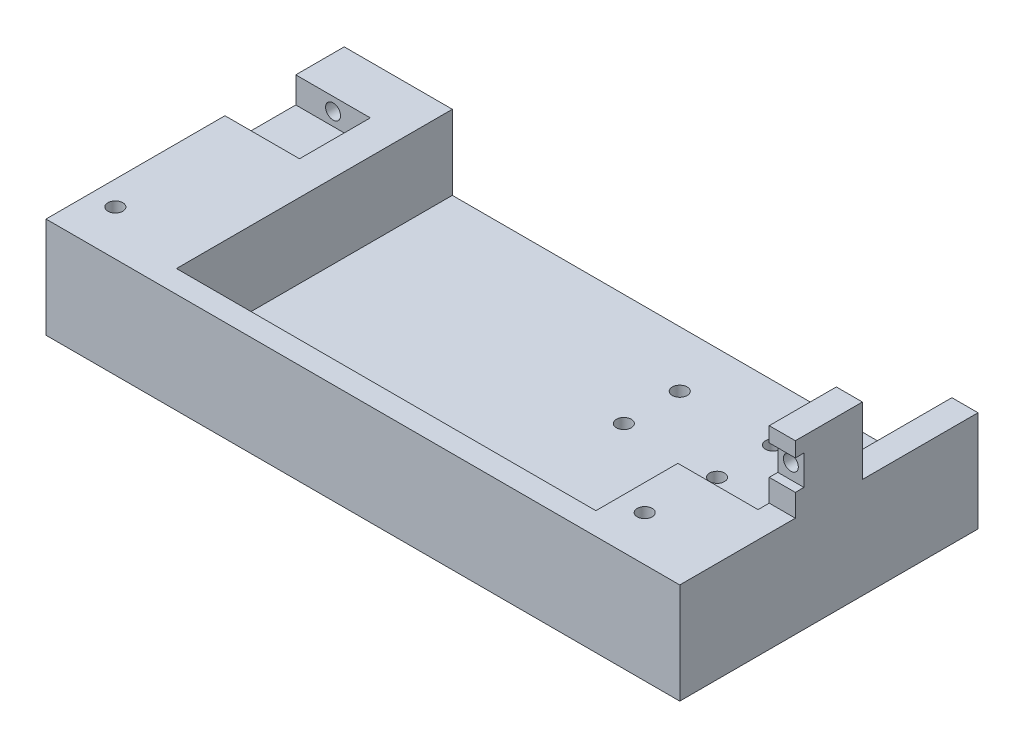
ISO-10303-21;
HEADER;
FILE_DESCRIPTION(('STEP AP214'),'2;1');
FILE_NAME('part.step','',(''),(''),'','','');
FILE_SCHEMA(('AUTOMOTIVE_DESIGN { 1 0 10303 214 1 1 1 1 }'));
ENDSEC;
DATA;
#1=APPLICATION_CONTEXT('core data for automotive mechanical design processes');
#2=APPLICATION_PROTOCOL_DEFINITION('international standard','automotive_design',2000,#1);
#3=PRODUCT_CONTEXT('',#1,'mechanical');
#4=PRODUCT('Part','Part','',(#3));
#5=PRODUCT_RELATED_PRODUCT_CATEGORY('part','',(#4));
#6=PRODUCT_DEFINITION_FORMATION('','',#4);
#7=PRODUCT_DEFINITION_CONTEXT('part definition',#1,'design');
#8=PRODUCT_DEFINITION('design','',#6,#7);
#9=PRODUCT_DEFINITION_SHAPE('','',#8);
#10=(LENGTH_UNIT() NAMED_UNIT(*) SI_UNIT(.MILLI.,.METRE.));
#11=(NAMED_UNIT(*) PLANE_ANGLE_UNIT() SI_UNIT($,.RADIAN.));
#12=(NAMED_UNIT(*) SI_UNIT($,.STERADIAN.) SOLID_ANGLE_UNIT());
#13=UNCERTAINTY_MEASURE_WITH_UNIT(LENGTH_MEASURE(1.E-05),#10,'distance_accuracy_value','');
#14=(GEOMETRIC_REPRESENTATION_CONTEXT(3) GLOBAL_UNCERTAINTY_ASSIGNED_CONTEXT((#13)) GLOBAL_UNIT_ASSIGNED_CONTEXT((#10,
#11,#12)) REPRESENTATION_CONTEXT('',''));
#15=CARTESIAN_POINT('',(0.,0.,0.));
#16=DIRECTION('',(0.,0.,1.));
#17=DIRECTION('',(1.,0.,0.));
#18=AXIS2_PLACEMENT_3D('',#15,#16,#17);
#19=CARTESIAN_POINT('',(253.170316301703,25.,-8.70802919708036));
#20=DIRECTION('',(1.,0.,0.));
#21=DIRECTION('',(0.,0.,1.));
#22=AXIS2_PLACEMENT_3D('',#19,#20,#21);
#23=PLANE('',#22);
#24=DIRECTION('',(0.,-1.,0.));
#25=VECTOR('',#24,1.);
#26=CARTESIAN_POINT('',(253.170316301703,7.,12.2919708029196));
#27=LINE('',#26,#25);
#28=CARTESIAN_POINT('',(253.170316301703,7.,12.2919708029196));
#29=VERTEX_POINT('',#28);
#30=CARTESIAN_POINT('',(253.170316301703,-13.,12.2919708029196));
#31=VERTEX_POINT('',#30);
#32=EDGE_CURVE('E225',#29,#31,#27,.T.);
#33=ORIENTED_EDGE('',*,*,#32,.F.);
#34=DIRECTION('',(0.,0.,1.));
#35=VECTOR('',#34,1.);
#36=CARTESIAN_POINT('',(253.170316301703,7.,40.2919708029196));
#37=LINE('',#36,#35);
#38=CARTESIAN_POINT('',(253.170316301703,7.,9.29197080291963));
#39=VERTEX_POINT('',#38);
#40=EDGE_CURVE('E228',#39,#29,#37,.T.);
#41=ORIENTED_EDGE('',*,*,#40,.F.);
#42=DIRECTION('',(0.,-1.,0.));
#43=VECTOR('',#42,1.);
#44=CARTESIAN_POINT('',(253.170316301703,25.,9.29197080291964));
#45=LINE('',#44,#43);
#46=CARTESIAN_POINT('',(253.170316301703,13.,9.29197080291964));
#47=VERTEX_POINT('',#46);
#48=EDGE_CURVE('E334',#47,#39,#45,.T.);
#49=ORIENTED_EDGE('',*,*,#48,.F.);
#50=DIRECTION('',(0.,0.,1.));
#51=VECTOR('',#50,1.);
#52=CARTESIAN_POINT('',(253.170316301703,13.,6.99197080291964));
#53=LINE('',#52,#51);
#54=CARTESIAN_POINT('',(253.170316301703,13.,6.99197080291964));
#55=VERTEX_POINT('',#54);
#56=EDGE_CURVE('E308',#55,#47,#53,.T.);
#57=ORIENTED_EDGE('',*,*,#56,.F.);
#58=DIRECTION('',(0.,1.,0.));
#59=VECTOR('',#58,1.);
#60=CARTESIAN_POINT('',(253.170316301703,21.,6.99197080291964));
#61=LINE('',#60,#59);
#62=CARTESIAN_POINT('',(253.170316301703,21.,6.99197080291964));
#63=VERTEX_POINT('',#62);
#64=EDGE_CURVE('E293',#55,#63,#61,.T.);
#65=ORIENTED_EDGE('',*,*,#64,.T.);
#66=DIRECTION('',(0.,0.,1.));
#67=VECTOR('',#66,1.);
#68=CARTESIAN_POINT('',(253.170316301703,21.,6.99197080291964));
#69=LINE('',#68,#67);
#70=CARTESIAN_POINT('',(253.170316301703,21.,9.29197080291964));
#71=VERTEX_POINT('',#70);
#72=EDGE_CURVE('E305',#63,#71,#69,.T.);
#73=ORIENTED_EDGE('',*,*,#72,.T.);
#74=CARTESIAN_POINT('',(253.170316301703,25.,9.29197080291964));
#75=VERTEX_POINT('',#74);
#76=EDGE_CURVE('E335',#75,#71,#45,.T.);
#77=ORIENTED_EDGE('',*,*,#76,.F.);
#78=DIRECTION('',(0.,0.,-1.));
#79=VECTOR('',#78,1.);
#80=CARTESIAN_POINT('',(253.170316301703,25.,-8.70802919708036));
#81=LINE('',#80,#79);
#82=CARTESIAN_POINT('',(253.170316301703,25.,-8.70802919708036));
#83=VERTEX_POINT('',#82);
#84=EDGE_CURVE('E321',#75,#83,#81,.T.);
#85=ORIENTED_EDGE('',*,*,#84,.T.);
#86=DIRECTION('',(0.,-1.,0.));
#87=VECTOR('',#86,1.);
#88=CARTESIAN_POINT('',(253.170316301703,25.,-8.70802919708036));
#89=LINE('',#88,#87);
#90=CARTESIAN_POINT('',(253.170316301703,7.,-8.70802919708036));
#91=VERTEX_POINT('',#90);
#92=EDGE_CURVE('E331',#83,#91,#89,.T.);
#93=ORIENTED_EDGE('',*,*,#92,.T.);
#94=CARTESIAN_POINT('',(253.170316301703,7.,-39.7080291970804));
#95=VERTEX_POINT('',#94);
#96=EDGE_CURVE('E237',#95,#91,#37,.T.);
#97=ORIENTED_EDGE('',*,*,#96,.F.);
#98=DIRECTION('',(0.,1.,0.));
#99=VECTOR('',#98,1.);
#100=CARTESIAN_POINT('',(253.170316301703,-13.,-39.7080291970804));
#101=LINE('',#100,#99);
#102=CARTESIAN_POINT('',(253.170316301703,-13.,-39.7080291970804));
#103=VERTEX_POINT('',#102);
#104=EDGE_CURVE('E242',#103,#95,#101,.T.);
#105=ORIENTED_EDGE('',*,*,#104,.F.);
#106=DIRECTION('',(0.,0.,1.));
#107=VECTOR('',#106,1.);
#108=CARTESIAN_POINT('',(253.170316301703,-13.,40.2919708029196));
#109=LINE('',#108,#107);
#110=EDGE_CURVE('E229',#103,#31,#109,.T.);
#111=ORIENTED_EDGE('',*,*,#110,.T.);
#112=EDGE_LOOP('',(#33,#41,#49,#57,#65,#73,#77,#85,#93,#97,#105,#111));
#113=FACE_BOUND('',#112,.T.);
#114=ADVANCED_FACE('F32',(#113),#23,.F.);
#115=CARTESIAN_POINT('',(119.170316301703,-13.,40.2919708029197));
#116=DIRECTION('',(-1.,0.,0.));
#117=DIRECTION('',(0.,0.,-1.));
#118=AXIS2_PLACEMENT_3D('',#115,#116,#117);
#119=PLANE('',#118);
#120=DIRECTION('',(0.,0.,-1.));
#121=VECTOR('',#120,1.);
#122=CARTESIAN_POINT('',(119.170316301703,-13.,40.2919708029197));
#123=LINE('',#122,#121);
#124=CARTESIAN_POINT('',(119.170316301703,-13.,34.2919708029197));
#125=VERTEX_POINT('',#124);
#126=CARTESIAN_POINT('',(119.170316301703,-13.,-39.7080291970803));
#127=VERTEX_POINT('',#126);
#128=EDGE_CURVE('E206',#125,#127,#123,.T.);
#129=ORIENTED_EDGE('',*,*,#128,.T.);
#130=DIRECTION('',(0.,1.,0.));
#131=VECTOR('',#130,1.);
#132=CARTESIAN_POINT('',(119.170316301703,-13.,-39.7080291970803));
#133=LINE('',#132,#131);
#134=CARTESIAN_POINT('',(119.170316301703,7.,-39.7080291970803));
#135=VERTEX_POINT('',#134);
#136=EDGE_CURVE('E236',#127,#135,#133,.T.);
#137=ORIENTED_EDGE('',*,*,#136,.T.);
#138=DIRECTION('',(0.,0.,-1.));
#139=VECTOR('',#138,1.);
#140=CARTESIAN_POINT('',(119.170316301703,7.,40.2919708029197));
#141=LINE('',#140,#139);
#142=CARTESIAN_POINT('',(119.170316301703,7.,34.2919708029197));
#143=VERTEX_POINT('',#142);
#144=EDGE_CURVE('E232',#143,#135,#141,.T.);
#145=ORIENTED_EDGE('',*,*,#144,.F.);
#146=DIRECTION('',(0.,1.,0.));
#147=VECTOR('',#146,1.);
#148=CARTESIAN_POINT('',(119.170316301703,-13.,34.2919708029197));
#149=LINE('',#148,#147);
#150=EDGE_CURVE('E194',#125,#143,#149,.T.);
#151=ORIENTED_EDGE('',*,*,#150,.F.);
#152=EDGE_LOOP('',(#129,#137,#145,#151));
#153=FACE_BOUND('',#152,.T.);
#154=ADVANCED_FACE('F432',(#153),#119,.F.);
#155=CARTESIAN_POINT('',(180.340632603406,-13.,0.));
#156=DIRECTION('',(0.,-1.,0.));
#157=DIRECTION('',(0.,0.,-1.));
#158=AXIS2_PLACEMENT_3D('',#155,#156,#157);
#159=PLANE('',#158);
#160=CARTESIAN_POINT('',(195.170316301703,-13.,-24.7080291970803));
#161=DIRECTION('',(0.,-1.,0.));
#162=DIRECTION('',(0.,0.,1.));
#163=AXIS2_PLACEMENT_3D('',#160,#161,#162);
#164=CIRCLE('',#163,2.);
#165=CARTESIAN_POINT('',(195.170316301703,-13.,-22.7080291970803));
#166=VERTEX_POINT('',#165);
#167=EDGE_CURVE('E402',#166,#166,#164,.T.);
#168=ORIENTED_EDGE('',*,*,#167,.T.);
#169=EDGE_LOOP('',(#168));
#170=FACE_BOUND('',#169,.T.);
#171=CARTESIAN_POINT('',(195.170316301703,-13.,-9.70802919708035));
#172=DIRECTION('',(0.,-1.,0.));
#173=DIRECTION('',(0.,0.,1.));
#174=AXIS2_PLACEMENT_3D('',#171,#172,#173);
#175=CIRCLE('',#174,2.);
#176=CARTESIAN_POINT('',(195.170316301703,-13.,-7.70802919708035));
#177=VERTEX_POINT('',#176);
#178=EDGE_CURVE('E404',#177,#177,#175,.T.);
#179=ORIENTED_EDGE('',*,*,#178,.T.);
#180=EDGE_LOOP('',(#179));
#181=FACE_BOUND('',#180,.T.);
#182=CARTESIAN_POINT('',(220.170316301703,-13.,-9.70802919708036));
#183=DIRECTION('',(0.,-1.,0.));
#184=DIRECTION('',(0.,0.,1.));
#185=AXIS2_PLACEMENT_3D('',#182,#183,#184);
#186=CIRCLE('',#185,2.);
#187=CARTESIAN_POINT('',(220.170316301703,-13.,-7.70802919708035));
#188=VERTEX_POINT('',#187);
#189=EDGE_CURVE('E407',#188,#188,#186,.T.);
#190=ORIENTED_EDGE('',*,*,#189,.T.);
#191=EDGE_LOOP('',(#190));
#192=FACE_BOUND('',#191,.T.);
#193=CARTESIAN_POINT('',(220.170316301703,-13.,-24.7080291970804));
#194=DIRECTION('',(0.,-1.,0.));
#195=DIRECTION('',(0.,0.,1.));
#196=AXIS2_PLACEMENT_3D('',#193,#194,#195);
#197=CIRCLE('',#196,2.);
#198=CARTESIAN_POINT('',(220.170316301703,-13.,-22.7080291970804));
#199=VERTEX_POINT('',#198);
#200=EDGE_CURVE('E384',#199,#199,#197,.T.);
#201=ORIENTED_EDGE('',*,*,#200,.T.);
#202=EDGE_LOOP('',(#201));
#203=FACE_BOUND('',#202,.T.);
#204=DIRECTION('',(1.,0.,0.));
#205=VECTOR('',#204,1.);
#206=CARTESIAN_POINT('',(253.170316301703,-13.,12.2919708029196));
#207=LINE('',#206,#205);
#208=CARTESIAN_POINT('',(231.670316301703,-13.,12.2919708029196));
#209=VERTEX_POINT('',#208);
#210=EDGE_CURVE('E223',#209,#31,#207,.T.);
#211=ORIENTED_EDGE('',*,*,#210,.T.);
#212=ORIENTED_EDGE('',*,*,#110,.F.);
#213=DIRECTION('',(1.,0.,0.));
#214=VECTOR('',#213,1.);
#215=CARTESIAN_POINT('',(253.170316301703,-13.,-39.7080291970804));
#216=LINE('',#215,#214);
#217=EDGE_CURVE('E234',#127,#103,#216,.T.);
#218=ORIENTED_EDGE('',*,*,#217,.F.);
#219=ORIENTED_EDGE('',*,*,#128,.F.);
#220=DIRECTION('',(-1.,0.,0.));
#221=VECTOR('',#220,1.);
#222=CARTESIAN_POINT('',(231.670316301703,-13.,34.2919708029196));
#223=LINE('',#222,#221);
#224=CARTESIAN_POINT('',(231.670316301703,-13.,34.2919708029196));
#225=VERTEX_POINT('',#224);
#226=EDGE_CURVE('E188',#225,#125,#223,.T.);
#227=ORIENTED_EDGE('',*,*,#226,.F.);
#228=DIRECTION('',(0.,0.,1.));
#229=VECTOR('',#228,1.);
#230=CARTESIAN_POINT('',(231.670316301703,-13.,12.2919708029196));
#231=LINE('',#230,#229);
#232=EDGE_CURVE('E197',#209,#225,#231,.T.);
#233=ORIENTED_EDGE('',*,*,#232,.F.);
#234=EDGE_LOOP('',(#211,#212,#218,#219,#227,#233));
#235=FACE_BOUND('',#234,.T.);
#236=ADVANCED_FACE('F204',(#170,#181,#192,#203,#235),#159,.F.);
#237=CARTESIAN_POINT('',(180.340632603406,7.,0.));
#238=DIRECTION('',(0.,1.,0.));
#239=DIRECTION('',(0.,0.,1.));
#240=AXIS2_PLACEMENT_3D('',#237,#238,#239);
#241=PLANE('',#240);
#242=ORIENTED_EDGE('',*,*,#96,.T.);
#243=DIRECTION('',(1.,0.,0.));
#244=VECTOR('',#243,1.);
#245=CARTESIAN_POINT('',(260.170316301703,7.,-8.70802919708036));
#246=LINE('',#245,#244);
#247=CARTESIAN_POINT('',(260.170316301703,7.,-8.70802919708036));
#248=VERTEX_POINT('',#247);
#249=EDGE_CURVE('E319',#91,#248,#246,.T.);
#250=ORIENTED_EDGE('',*,*,#249,.T.);
#251=DIRECTION('',(0.,0.,1.));
#252=VECTOR('',#251,1.);
#253=CARTESIAN_POINT('',(260.170316301703,7.,-39.7080291970804));
#254=LINE('',#253,#252);
#255=CARTESIAN_POINT('',(260.170316301703,7.,-39.7080291970804));
#256=VERTEX_POINT('',#255);
#257=EDGE_CURVE('E343',#256,#248,#254,.T.);
#258=ORIENTED_EDGE('',*,*,#257,.F.);
#259=DIRECTION('',(1.,0.,0.));
#260=VECTOR('',#259,1.);
#261=CARTESIAN_POINT('',(260.170316301703,7.,-39.7080291970804));
#262=LINE('',#261,#260);
#263=EDGE_CURVE('E353',#95,#256,#262,.T.);
#264=ORIENTED_EDGE('',*,*,#263,.F.);
#265=EDGE_LOOP('',(#242,#250,#258,#264));
#266=FACE_BOUND('',#265,.T.);
#267=ADVANCED_FACE('F455',(#266),#241,.T.);
#268=CARTESIAN_POINT('',(260.170316301703,25.,9.29197080291963));
#269=DIRECTION('',(0.,0.,-1.));
#270=DIRECTION('',(1.,0.,0.));
#271=AXIS2_PLACEMENT_3D('',#268,#269,#270);
#272=PLANE('',#271);
#273=DIRECTION('',(0.,-1.,0.));
#274=VECTOR('',#273,1.);
#275=CARTESIAN_POINT('',(260.170316301703,25.,9.29197080291963));
#276=LINE('',#275,#274);
#277=CARTESIAN_POINT('',(260.170316301703,25.,9.29197080291963));
#278=VERTEX_POINT('',#277);
#279=CARTESIAN_POINT('',(260.170316301703,21.,9.29197080291963));
#280=VERTEX_POINT('',#279);
#281=EDGE_CURVE('E339',#278,#280,#276,.T.);
#282=ORIENTED_EDGE('',*,*,#281,.F.);
#283=DIRECTION('',(-1.,0.,0.));
#284=VECTOR('',#283,1.);
#285=CARTESIAN_POINT('',(260.170316301703,25.,9.29197080291963));
#286=LINE('',#285,#284);
#287=EDGE_CURVE('E318',#278,#75,#286,.T.);
#288=ORIENTED_EDGE('',*,*,#287,.T.);
#289=ORIENTED_EDGE('',*,*,#76,.T.);
#290=DIRECTION('',(1.,0.,0.));
#291=VECTOR('',#290,1.);
#292=CARTESIAN_POINT('',(260.170316301703,21.,9.29197080291963));
#293=LINE('',#292,#291);
#294=EDGE_CURVE('E291',#71,#280,#293,.T.);
#295=ORIENTED_EDGE('',*,*,#294,.T.);
#296=EDGE_LOOP('',(#282,#288,#289,#295));
#297=FACE_BOUND('',#296,.T.);
#298=ADVANCED_FACE('F450',(#297),#272,.F.);
#299=CARTESIAN_POINT('',(256.670316301703,17.,11.2919708029196));
#300=DIRECTION('',(0.,0.,-1.));
#301=DIRECTION('',(1.,0.,0.));
#302=AXIS2_PLACEMENT_3D('',#299,#300,#301);
#303=CYLINDRICAL_SURFACE('',#302,2.);
#304=CARTESIAN_POINT('',(256.670316301703,17.,-8.70802919708036));
#305=DIRECTION('',(0.,0.,1.));
#306=DIRECTION('',(1.,0.,0.));
#307=AXIS2_PLACEMENT_3D('',#304,#305,#306);
#308=CIRCLE('',#307,2.);
#309=CARTESIAN_POINT('',(258.670316301703,17.,-8.70802919708036));
#310=VERTEX_POINT('',#309);
#311=EDGE_CURVE('E312',#310,#310,#308,.T.);
#312=ORIENTED_EDGE('',*,*,#311,.F.);
#313=EDGE_LOOP('',(#312));
#314=FACE_BOUND('',#313,.T.);
#315=CARTESIAN_POINT('',(256.670316301703,17.,6.99197080291963));
#316=DIRECTION('',(0.,0.,-1.));
#317=DIRECTION('',(-1.,0.,0.));
#318=AXIS2_PLACEMENT_3D('',#315,#316,#317);
#319=CIRCLE('',#318,2.);
#320=CARTESIAN_POINT('',(254.670316301703,17.,6.99197080291964));
#321=VERTEX_POINT('',#320);
#322=EDGE_CURVE('E304',#321,#321,#319,.F.);
#323=ORIENTED_EDGE('',*,*,#322,.T.);
#324=EDGE_LOOP('',(#323));
#325=FACE_BOUND('',#324,.T.);
#326=ADVANCED_FACE('F468',(#314,#325),#303,.F.);
#327=CARTESIAN_POINT('',(260.170316301703,7.,-39.7080291970804));
#328=DIRECTION('',(-1.,0.,0.));
#329=DIRECTION('',(0.,0.,-1.));
#330=AXIS2_PLACEMENT_3D('',#327,#328,#329);
#331=PLANE('',#330);
#332=DIRECTION('',(0.,-1.,0.));
#333=VECTOR('',#332,1.);
#334=CARTESIAN_POINT('',(260.170316301703,21.,6.99197080291963));
#335=LINE('',#334,#333);
#336=CARTESIAN_POINT('',(260.170316301703,21.,6.99197080291963));
#337=VERTEX_POINT('',#336);
#338=CARTESIAN_POINT('',(260.170316301703,13.,6.99197080291963));
#339=VERTEX_POINT('',#338);
#340=EDGE_CURVE('E288',#337,#339,#335,.T.);
#341=ORIENTED_EDGE('',*,*,#340,.T.);
#342=DIRECTION('',(0.,0.,1.));
#343=VECTOR('',#342,1.);
#344=CARTESIAN_POINT('',(260.170316301703,13.,6.99197080291963));
#345=LINE('',#344,#343);
#346=CARTESIAN_POINT('',(260.170316301703,13.,9.29197080291963));
#347=VERTEX_POINT('',#346);
#348=EDGE_CURVE('E298',#339,#347,#345,.T.);
#349=ORIENTED_EDGE('',*,*,#348,.T.);
#350=CARTESIAN_POINT('',(260.170316301703,7.,9.29197080291963));
#351=VERTEX_POINT('',#350);
#352=EDGE_CURVE('E338',#347,#351,#276,.T.);
#353=ORIENTED_EDGE('',*,*,#352,.T.);
#354=CARTESIAN_POINT('',(260.170316301703,7.,40.2919708029196));
#355=VERTEX_POINT('',#354);
#356=EDGE_CURVE('E342',#351,#355,#254,.T.);
#357=ORIENTED_EDGE('',*,*,#356,.T.);
#358=DIRECTION('',(0.,-1.,0.));
#359=VECTOR('',#358,1.);
#360=CARTESIAN_POINT('',(260.170316301703,7.,40.2919708029196));
#361=LINE('',#360,#359);
#362=CARTESIAN_POINT('',(260.170316301703,-20.,40.2919708029196));
#363=VERTEX_POINT('',#362);
#364=EDGE_CURVE('E365',#355,#363,#361,.T.);
#365=ORIENTED_EDGE('',*,*,#364,.T.);
#366=DIRECTION('',(0.,0.,-1.));
#367=VECTOR('',#366,1.);
#368=CARTESIAN_POINT('',(260.170316301703,-20.,40.2919708029196));
#369=LINE('',#368,#367);
#370=CARTESIAN_POINT('',(260.170316301703,-20.,-39.7080291970804));
#371=VERTEX_POINT('',#370);
#372=EDGE_CURVE('E248',#363,#371,#369,.T.);
#373=ORIENTED_EDGE('',*,*,#372,.T.);
#374=DIRECTION('',(0.,-1.,0.));
#375=VECTOR('',#374,1.);
#376=CARTESIAN_POINT('',(260.170316301703,7.,-39.7080291970804));
#377=LINE('',#376,#375);
#378=EDGE_CURVE('E356',#256,#371,#377,.T.);
#379=ORIENTED_EDGE('',*,*,#378,.F.);
#380=ORIENTED_EDGE('',*,*,#257,.T.);
#381=DIRECTION('',(0.,-1.,0.));
#382=VECTOR('',#381,1.);
#383=CARTESIAN_POINT('',(260.170316301703,25.,-8.70802919708036));
#384=LINE('',#383,#382);
#385=CARTESIAN_POINT('',(260.170316301703,25.,-8.70802919708036));
#386=VERTEX_POINT('',#385);
#387=EDGE_CURVE('E326',#386,#248,#384,.T.);
#388=ORIENTED_EDGE('',*,*,#387,.F.);
#389=DIRECTION('',(0.,0.,1.));
#390=VECTOR('',#389,1.);
#391=CARTESIAN_POINT('',(260.170316301703,25.,-8.70802919708036));
#392=LINE('',#391,#390);
#393=EDGE_CURVE('E316',#386,#278,#392,.T.);
#394=ORIENTED_EDGE('',*,*,#393,.T.);
#395=ORIENTED_EDGE('',*,*,#281,.T.);
#396=DIRECTION('',(0.,0.,1.));
#397=VECTOR('',#396,1.);
#398=CARTESIAN_POINT('',(260.170316301703,21.,6.99197080291963));
#399=LINE('',#398,#397);
#400=EDGE_CURVE('E302',#337,#280,#399,.T.);
#401=ORIENTED_EDGE('',*,*,#400,.F.);
#402=EDGE_LOOP('',(#341,#349,#353,#357,#365,#373,#379,#380,#388,#394,#395,#401));
#403=FACE_BOUND('',#402,.T.);
#404=ADVANCED_FACE('F34',(#403),#331,.F.);
#405=CARTESIAN_POINT('',(260.170316301703,7.,40.2919708029196));
#406=DIRECTION('',(0.,0.,-1.));
#407=DIRECTION('',(1.,0.,0.));
#408=AXIS2_PLACEMENT_3D('',#405,#406,#407);
#409=PLANE('',#408);
#410=DIRECTION('',(0.,-1.,0.));
#411=VECTOR('',#410,1.);
#412=CARTESIAN_POINT('',(90.1703163017031,7.,40.2919708029197));
#413=LINE('',#412,#411);
#414=CARTESIAN_POINT('',(90.1703163017031,7.,40.2919708029197));
#415=VERTEX_POINT('',#414);
#416=CARTESIAN_POINT('',(90.1703163017032,-20.,40.2919708029197));
#417=VERTEX_POINT('',#416);
#418=EDGE_CURVE('E362',#415,#417,#413,.T.);
#419=ORIENTED_EDGE('',*,*,#418,.T.);
#420=DIRECTION('',(1.,0.,0.));
#421=VECTOR('',#420,1.);
#422=CARTESIAN_POINT('',(260.170316301703,-20.,40.2919708029196));
#423=LINE('',#422,#421);
#424=EDGE_CURVE('E255',#417,#363,#423,.T.);
#425=ORIENTED_EDGE('',*,*,#424,.T.);
#426=ORIENTED_EDGE('',*,*,#364,.F.);
#427=DIRECTION('',(-1.,0.,0.));
#428=VECTOR('',#427,1.);
#429=CARTESIAN_POINT('',(260.170316301703,7.,40.2919708029196));
#430=LINE('',#429,#428);
#431=EDGE_CURVE('E346',#355,#415,#430,.T.);
#432=ORIENTED_EDGE('',*,*,#431,.T.);
#433=EDGE_LOOP('',(#419,#425,#426,#432));
#434=FACE_BOUND('',#433,.T.);
#435=ADVANCED_FACE('F461',(#434),#409,.F.);
#436=CARTESIAN_POINT('',(90.1703163017031,7.,-39.7080291970803));
#437=DIRECTION('',(1.,0.,0.));
#438=DIRECTION('',(0.,0.,1.));
#439=AXIS2_PLACEMENT_3D('',#436,#437,#438);
#440=PLANE('',#439);
#441=ORIENTED_EDGE('',*,*,#418,.F.);
#442=DIRECTION('',(0.,0.,-1.));
#443=VECTOR('',#442,1.);
#444=CARTESIAN_POINT('',(90.1703163017031,7.,-39.7080291970803));
#445=LINE('',#444,#443);
#446=CARTESIAN_POINT('',(90.1703163017031,7.,-7.70802919708031));
#447=VERTEX_POINT('',#446);
#448=EDGE_CURVE('E350',#415,#447,#445,.T.);
#449=ORIENTED_EDGE('',*,*,#448,.T.);
#450=DIRECTION('',(0.,1.,0.));
#451=VECTOR('',#450,1.);
#452=CARTESIAN_POINT('',(90.1703163017031,-4.,-7.70802919708031));
#453=LINE('',#452,#451);
#454=CARTESIAN_POINT('',(90.1703163017031,0.,-7.70802919708031));
#455=VERTEX_POINT('',#454);
#456=EDGE_CURVE('E284',#455,#447,#453,.T.);
#457=ORIENTED_EDGE('',*,*,#456,.F.);
#458=DIRECTION('',(0.,0.,1.));
#459=VECTOR('',#458,1.);
#460=CARTESIAN_POINT('',(90.1703163017032,0.,40.2919708029197));
#461=LINE('',#460,#459);
#462=CARTESIAN_POINT('',(90.1703163017031,0.,-26.7080291970803));
#463=VERTEX_POINT('',#462);
#464=EDGE_CURVE('E245',#463,#455,#461,.T.);
#465=ORIENTED_EDGE('',*,*,#464,.F.);
#466=DIRECTION('',(0.,1.,0.));
#467=VECTOR('',#466,1.);
#468=CARTESIAN_POINT('',(90.1703163017031,-4.,-26.7080291970803));
#469=LINE('',#468,#467);
#470=CARTESIAN_POINT('',(90.1703163017031,7.,-26.7080291970803));
#471=VERTEX_POINT('',#470);
#472=EDGE_CURVE('E281',#463,#471,#469,.T.);
#473=ORIENTED_EDGE('',*,*,#472,.T.);
#474=CARTESIAN_POINT('',(90.1703163017031,7.,-39.7080291970803));
#475=VERTEX_POINT('',#474);
#476=EDGE_CURVE('E349',#471,#475,#445,.T.);
#477=ORIENTED_EDGE('',*,*,#476,.T.);
#478=DIRECTION('',(0.,-1.,0.));
#479=VECTOR('',#478,1.);
#480=CARTESIAN_POINT('',(90.1703163017031,7.,-39.7080291970803));
#481=LINE('',#480,#479);
#482=CARTESIAN_POINT('',(90.1703163017031,-20.,-39.7080291970803));
#483=VERTEX_POINT('',#482);
#484=EDGE_CURVE('E359',#475,#483,#481,.T.);
#485=ORIENTED_EDGE('',*,*,#484,.T.);
#486=DIRECTION('',(0.,0.,1.));
#487=VECTOR('',#486,1.);
#488=CARTESIAN_POINT('',(90.1703163017032,-20.,40.2919708029197));
#489=LINE('',#488,#487);
#490=EDGE_CURVE('E253',#483,#417,#489,.T.);
#491=ORIENTED_EDGE('',*,*,#490,.T.);
#492=EDGE_LOOP('',(#441,#449,#457,#465,#473,#477,#485,#491));
#493=FACE_BOUND('',#492,.T.);
#494=ADVANCED_FACE('F458',(#493),#440,.F.);
#495=CARTESIAN_POINT('',(260.170316301703,7.,-39.7080291970804));
#496=DIRECTION('',(0.,0.,1.));
#497=DIRECTION('',(-1.,0.,0.));
#498=AXIS2_PLACEMENT_3D('',#495,#496,#497);
#499=PLANE('',#498);
#500=ORIENTED_EDGE('',*,*,#263,.T.);
#501=ORIENTED_EDGE('',*,*,#378,.T.);
#502=DIRECTION('',(-1.,0.,0.));
#503=VECTOR('',#502,1.);
#504=CARTESIAN_POINT('',(260.170316301703,-20.,-39.7080291970804));
#505=LINE('',#504,#503);
#506=EDGE_CURVE('E251',#371,#483,#505,.T.);
#507=ORIENTED_EDGE('',*,*,#506,.T.);
#508=ORIENTED_EDGE('',*,*,#484,.F.);
#509=EDGE_CURVE('E354',#475,#135,#262,.T.);
#510=ORIENTED_EDGE('',*,*,#509,.T.);
#511=ORIENTED_EDGE('',*,*,#136,.F.);
#512=ORIENTED_EDGE('',*,*,#217,.T.);
#513=ORIENTED_EDGE('',*,*,#104,.T.);
#514=EDGE_LOOP('',(#500,#501,#507,#508,#510,#511,#512,#513));
#515=FACE_BOUND('',#514,.T.);
#516=CARTESIAN_POINT('',(100.170316301703,3.5,-39.7080291970803));
#517=DIRECTION('',(0.,0.,-1.));
#518=DIRECTION('',(-1.,0.,0.));
#519=AXIS2_PLACEMENT_3D('',#516,#517,#518);
#520=CIRCLE('',#519,2.);
#521=CARTESIAN_POINT('',(98.1703163017031,3.5,-39.7080291970803));
#522=VERTEX_POINT('',#521);
#523=EDGE_CURVE('E266',#522,#522,#520,.T.);
#524=ORIENTED_EDGE('',*,*,#523,.F.);
#525=EDGE_LOOP('',(#524));
#526=FACE_BOUND('',#525,.T.);
#527=ADVANCED_FACE('F453',(#515,#526),#499,.F.);
#528=DIRECTION('',(0.,0.,1.));
#529=VECTOR('',#528,1.);
#530=CARTESIAN_POINT('',(231.670316301703,7.,12.2919708029196));
#531=LINE('',#530,#529);
#532=CARTESIAN_POINT('',(231.670316301703,7.,12.2919708029196));
#533=VERTEX_POINT('',#532);
#534=CARTESIAN_POINT('',(231.670316301703,7.,34.2919708029196));
#535=VERTEX_POINT('',#534);
#536=EDGE_CURVE('E210',#533,#535,#531,.T.);
#537=ORIENTED_EDGE('',*,*,#536,.T.);
#538=DIRECTION('',(-1.,0.,0.));
#539=VECTOR('',#538,1.);
#540=CARTESIAN_POINT('',(231.670316301703,7.,34.2919708029196));
#541=LINE('',#540,#539);
#542=EDGE_CURVE('E190',#535,#143,#541,.T.);
#543=ORIENTED_EDGE('',*,*,#542,.T.);
#544=ORIENTED_EDGE('',*,*,#144,.T.);
#545=ORIENTED_EDGE('',*,*,#509,.F.);
#546=ORIENTED_EDGE('',*,*,#476,.F.);
#547=DIRECTION('',(1.,0.,0.));
#548=VECTOR('',#547,1.);
#549=CARTESIAN_POINT('',(110.170316301703,7.,-26.7080291970803));
#550=LINE('',#549,#548);
#551=CARTESIAN_POINT('',(110.170316301703,7.,-26.7080291970803));
#552=VERTEX_POINT('',#551);
#553=EDGE_CURVE('E274',#471,#552,#550,.T.);
#554=ORIENTED_EDGE('',*,*,#553,.T.);
#555=DIRECTION('',(0.,0.,1.));
#556=VECTOR('',#555,1.);
#557=CARTESIAN_POINT('',(110.170316301703,7.,-7.70802919708032));
#558=LINE('',#557,#556);
#559=CARTESIAN_POINT('',(110.170316301703,7.,-7.70802919708032));
#560=VERTEX_POINT('',#559);
#561=EDGE_CURVE('E269',#552,#560,#558,.T.);
#562=ORIENTED_EDGE('',*,*,#561,.T.);
#563=DIRECTION('',(-1.,0.,0.));
#564=VECTOR('',#563,1.);
#565=CARTESIAN_POINT('',(110.170316301703,7.,-7.70802919708032));
#566=LINE('',#565,#564);
#567=EDGE_CURVE('E272',#560,#447,#566,.T.);
#568=ORIENTED_EDGE('',*,*,#567,.T.);
#569=ORIENTED_EDGE('',*,*,#448,.F.);
#570=ORIENTED_EDGE('',*,*,#431,.F.);
#571=ORIENTED_EDGE('',*,*,#356,.F.);
#572=DIRECTION('',(-1.,0.,0.));
#573=VECTOR('',#572,1.);
#574=CARTESIAN_POINT('',(260.170316301703,7.,9.29197080291963));
#575=LINE('',#574,#573);
#576=EDGE_CURVE('E315',#351,#39,#575,.T.);
#577=ORIENTED_EDGE('',*,*,#576,.T.);
#578=ORIENTED_EDGE('',*,*,#40,.T.);
#579=DIRECTION('',(1.,0.,0.));
#580=VECTOR('',#579,1.);
#581=CARTESIAN_POINT('',(253.170316301703,7.,12.2919708029196));
#582=LINE('',#581,#580);
#583=EDGE_CURVE('E49',#533,#29,#582,.T.);
#584=ORIENTED_EDGE('',*,*,#583,.F.);
#585=EDGE_LOOP('',(#537,#543,#544,#545,#546,#554,#562,#568,#569,#570,#571,#577,#578,#584));
#586=FACE_BOUND('',#585,.T.);
#587=CARTESIAN_POINT('',(96.6703163017031,7.,28.1919708029197));
#588=DIRECTION('',(0.,-1.,0.));
#589=DIRECTION('',(0.,0.,1.));
#590=AXIS2_PLACEMENT_3D('',#587,#588,#589);
#591=CIRCLE('',#590,2.);
#592=CARTESIAN_POINT('',(96.6703163017031,7.,30.1919708029197));
#593=VERTEX_POINT('',#592);
#594=EDGE_CURVE('E220',#593,#593,#591,.T.);
#595=ORIENTED_EDGE('',*,*,#594,.T.);
#596=EDGE_LOOP('',(#595));
#597=FACE_BOUND('',#596,.T.);
#598=CARTESIAN_POINT('',(238.670316301703,7.,28.1919708029196));
#599=DIRECTION('',(0.,-1.,0.));
#600=DIRECTION('',(0.,0.,1.));
#601=AXIS2_PLACEMENT_3D('',#598,#599,#600);
#602=CIRCLE('',#601,2.);
#603=CARTESIAN_POINT('',(238.670316301703,7.,30.1919708029196));
#604=VERTEX_POINT('',#603);
#605=EDGE_CURVE('E216',#604,#604,#602,.T.);
#606=ORIENTED_EDGE('',*,*,#605,.T.);
#607=EDGE_LOOP('',(#606));
#608=FACE_BOUND('',#607,.T.);
#609=ADVANCED_FACE('F448',(#586,#597,#608),#241,.T.);
#610=ORIENTED_EDGE('',*,*,#48,.T.);
#611=ORIENTED_EDGE('',*,*,#576,.F.);
#612=ORIENTED_EDGE('',*,*,#352,.F.);
#613=DIRECTION('',(-1.,0.,0.));
#614=VECTOR('',#613,1.);
#615=CARTESIAN_POINT('',(260.170316301703,13.,9.29197080291963));
#616=LINE('',#615,#614);
#617=EDGE_CURVE('E280',#347,#47,#616,.T.);
#618=ORIENTED_EDGE('',*,*,#617,.T.);
#619=EDGE_LOOP('',(#610,#611,#612,#618));
#620=FACE_BOUND('',#619,.T.);
#621=ADVANCED_FACE('F445',(#620),#272,.F.);
#622=CARTESIAN_POINT('',(260.170316301703,25.,-8.70802919708036));
#623=DIRECTION('',(0.,0.,1.));
#624=DIRECTION('',(-1.,0.,0.));
#625=AXIS2_PLACEMENT_3D('',#622,#623,#624);
#626=PLANE('',#625);
#627=ORIENTED_EDGE('',*,*,#311,.T.);
#628=EDGE_LOOP('',(#627));
#629=FACE_BOUND('',#628,.T.);
#630=ORIENTED_EDGE('',*,*,#249,.F.);
#631=ORIENTED_EDGE('',*,*,#92,.F.);
#632=DIRECTION('',(1.,0.,0.));
#633=VECTOR('',#632,1.);
#634=CARTESIAN_POINT('',(260.170316301703,25.,-8.70802919708036));
#635=LINE('',#634,#633);
#636=EDGE_CURVE('E324',#83,#386,#635,.T.);
#637=ORIENTED_EDGE('',*,*,#636,.T.);
#638=ORIENTED_EDGE('',*,*,#387,.T.);
#639=EDGE_LOOP('',(#630,#631,#637,#638));
#640=FACE_BOUND('',#639,.T.);
#641=ADVANCED_FACE('F443',(#629,#640),#626,.F.);
#642=CARTESIAN_POINT('',(180.340632603406,25.,0.));
#643=DIRECTION('',(0.,1.,0.));
#644=DIRECTION('',(0.,0.,1.));
#645=AXIS2_PLACEMENT_3D('',#642,#643,#644);
#646=PLANE('',#645);
#647=ORIENTED_EDGE('',*,*,#393,.F.);
#648=ORIENTED_EDGE('',*,*,#636,.F.);
#649=ORIENTED_EDGE('',*,*,#84,.F.);
#650=ORIENTED_EDGE('',*,*,#287,.F.);
#651=EDGE_LOOP('',(#647,#648,#649,#650));
#652=FACE_BOUND('',#651,.T.);
#653=ADVANCED_FACE('F513',(#652),#646,.T.);
#654=CARTESIAN_POINT('',(180.340632603406,0.,6.99197080291966));
#655=DIRECTION('',(0.,0.,1.));
#656=DIRECTION('',(-1.,0.,0.));
#657=AXIS2_PLACEMENT_3D('',#654,#655,#656);
#658=PLANE('',#657);
#659=ORIENTED_EDGE('',*,*,#340,.F.);
#660=DIRECTION('',(1.,0.,0.));
#661=VECTOR('',#660,1.);
#662=CARTESIAN_POINT('',(260.170316301703,21.,6.99197080291963));
#663=LINE('',#662,#661);
#664=EDGE_CURVE('E296',#63,#337,#663,.T.);
#665=ORIENTED_EDGE('',*,*,#664,.F.);
#666=ORIENTED_EDGE('',*,*,#64,.F.);
#667=DIRECTION('',(-1.,0.,0.));
#668=VECTOR('',#667,1.);
#669=CARTESIAN_POINT('',(260.170316301703,13.,6.99197080291963));
#670=LINE('',#669,#668);
#671=EDGE_CURVE('E57',#339,#55,#670,.T.);
#672=ORIENTED_EDGE('',*,*,#671,.F.);
#673=EDGE_LOOP('',(#659,#665,#666,#672));
#674=FACE_BOUND('',#673,.T.);
#675=ORIENTED_EDGE('',*,*,#322,.F.);
#676=EDGE_LOOP('',(#675));
#677=FACE_BOUND('',#676,.T.);
#678=ADVANCED_FACE('F523',(#674,#677),#658,.T.);
#679=CARTESIAN_POINT('',(260.170316301703,21.,6.99197080291963));
#680=DIRECTION('',(0.,1.,0.));
#681=DIRECTION('',(0.,0.,1.));
#682=AXIS2_PLACEMENT_3D('',#679,#680,#681);
#683=PLANE('',#682);
#684=ORIENTED_EDGE('',*,*,#294,.F.);
#685=ORIENTED_EDGE('',*,*,#72,.F.);
#686=ORIENTED_EDGE('',*,*,#664,.T.);
#687=ORIENTED_EDGE('',*,*,#400,.T.);
#688=EDGE_LOOP('',(#684,#685,#686,#687));
#689=FACE_BOUND('',#688,.T.);
#690=ADVANCED_FACE('F521',(#689),#683,.F.);
#691=CARTESIAN_POINT('',(260.170316301703,13.,6.99197080291963));
#692=DIRECTION('',(0.,-1.,0.));
#693=DIRECTION('',(0.,0.,-1.));
#694=AXIS2_PLACEMENT_3D('',#691,#692,#693);
#695=PLANE('',#694);
#696=ORIENTED_EDGE('',*,*,#617,.F.);
#697=ORIENTED_EDGE('',*,*,#348,.F.);
#698=ORIENTED_EDGE('',*,*,#671,.T.);
#699=ORIENTED_EDGE('',*,*,#56,.T.);
#700=EDGE_LOOP('',(#696,#697,#698,#699));
#701=FACE_BOUND('',#700,.T.);
#702=ADVANCED_FACE('F526',(#701),#695,.F.);
#703=CARTESIAN_POINT('',(110.170316301703,-4.,-7.70802919708032));
#704=DIRECTION('',(1.,0.,0.));
#705=DIRECTION('',(0.,0.,1.));
#706=AXIS2_PLACEMENT_3D('',#703,#704,#705);
#707=PLANE('',#706);
#708=DIRECTION('',(0.,1.,0.));
#709=VECTOR('',#708,1.);
#710=CARTESIAN_POINT('',(110.170316301703,-4.,-26.7080291970803));
#711=LINE('',#710,#709);
#712=CARTESIAN_POINT('',(110.170316301703,0.,-26.7080291970803));
#713=VERTEX_POINT('',#712);
#714=EDGE_CURVE('E278',#713,#552,#711,.T.);
#715=ORIENTED_EDGE('',*,*,#714,.F.);
#716=DIRECTION('',(0.,0.,1.));
#717=VECTOR('',#716,1.);
#718=CARTESIAN_POINT('',(110.170316301703,0.,0.));
#719=LINE('',#718,#717);
#720=CARTESIAN_POINT('',(110.170316301703,0.,-7.70802919708032));
#721=VERTEX_POINT('',#720);
#722=EDGE_CURVE('E41',#713,#721,#719,.T.);
#723=ORIENTED_EDGE('',*,*,#722,.T.);
#724=DIRECTION('',(0.,1.,0.));
#725=VECTOR('',#724,1.);
#726=CARTESIAN_POINT('',(110.170316301703,-4.,-7.70802919708032));
#727=LINE('',#726,#725);
#728=EDGE_CURVE('E277',#721,#560,#727,.T.);
#729=ORIENTED_EDGE('',*,*,#728,.T.);
#730=ORIENTED_EDGE('',*,*,#561,.F.);
#731=EDGE_LOOP('',(#715,#723,#729,#730));
#732=FACE_BOUND('',#731,.T.);
#733=ADVANCED_FACE('F563',(#732),#707,.F.);
#734=CARTESIAN_POINT('',(110.170316301703,-4.,-26.7080291970803));
#735=DIRECTION('',(0.,0.,-1.));
#736=DIRECTION('',(1.,0.,0.));
#737=AXIS2_PLACEMENT_3D('',#734,#735,#736);
#738=PLANE('',#737);
#739=CARTESIAN_POINT('',(100.170316301703,3.5,-26.7080291970803));
#740=DIRECTION('',(0.,0.,-1.));
#741=DIRECTION('',(-1.,0.,0.));
#742=AXIS2_PLACEMENT_3D('',#739,#740,#741);
#743=CIRCLE('',#742,2.);
#744=CARTESIAN_POINT('',(98.1703163017031,3.5,-26.7080291970803));
#745=VERTEX_POINT('',#744);
#746=EDGE_CURVE('E263',#745,#745,#743,.T.);
#747=ORIENTED_EDGE('',*,*,#746,.T.);
#748=EDGE_LOOP('',(#747));
#749=FACE_BOUND('',#748,.T.);
#750=ORIENTED_EDGE('',*,*,#472,.F.);
#751=DIRECTION('',(1.,0.,0.));
#752=VECTOR('',#751,1.);
#753=CARTESIAN_POINT('',(180.340632603406,0.,-26.7080291970803));
#754=LINE('',#753,#752);
#755=EDGE_CURVE('E11',#463,#713,#754,.T.);
#756=ORIENTED_EDGE('',*,*,#755,.T.);
#757=ORIENTED_EDGE('',*,*,#714,.T.);
#758=ORIENTED_EDGE('',*,*,#553,.F.);
#759=EDGE_LOOP('',(#750,#756,#757,#758));
#760=FACE_BOUND('',#759,.T.);
#761=ADVANCED_FACE('F497',(#749,#760),#738,.F.);
#762=CARTESIAN_POINT('',(110.170316301703,-4.,-7.70802919708032));
#763=DIRECTION('',(0.,0.,1.));
#764=DIRECTION('',(-1.,0.,0.));
#765=AXIS2_PLACEMENT_3D('',#762,#763,#764);
#766=PLANE('',#765);
#767=CARTESIAN_POINT('',(100.170316301703,3.5,-7.70802919708031));
#768=DIRECTION('',(0.,0.,-1.));
#769=DIRECTION('',(-1.,0.,0.));
#770=AXIS2_PLACEMENT_3D('',#767,#768,#769);
#771=CIRCLE('',#770,2.);
#772=CARTESIAN_POINT('',(98.1703163017031,3.5,-7.70802919708031));
#773=VERTEX_POINT('',#772);
#774=EDGE_CURVE('E262',#773,#773,#771,.F.);
#775=ORIENTED_EDGE('',*,*,#774,.T.);
#776=EDGE_LOOP('',(#775));
#777=FACE_BOUND('',#776,.T.);
#778=ORIENTED_EDGE('',*,*,#728,.F.);
#779=DIRECTION('',(-1.,0.,0.));
#780=VECTOR('',#779,1.);
#781=CARTESIAN_POINT('',(180.340632603406,0.,-7.70802919708034));
#782=LINE('',#781,#780);
#783=EDGE_CURVE('E368',#721,#455,#782,.T.);
#784=ORIENTED_EDGE('',*,*,#783,.T.);
#785=ORIENTED_EDGE('',*,*,#456,.T.);
#786=ORIENTED_EDGE('',*,*,#567,.F.);
#787=EDGE_LOOP('',(#778,#784,#785,#786));
#788=FACE_BOUND('',#787,.T.);
#789=ADVANCED_FACE('F489',(#777,#788),#766,.F.);
#790=CARTESIAN_POINT('',(100.170316301703,3.5,-51.7080291970803));
#791=DIRECTION('',(0.,0.,1.));
#792=DIRECTION('',(-1.,0.,0.));
#793=AXIS2_PLACEMENT_3D('',#790,#791,#792);
#794=CYLINDRICAL_SURFACE('',#793,2.);
#795=ORIENTED_EDGE('',*,*,#746,.F.);
#796=EDGE_LOOP('',(#795));
#797=FACE_BOUND('',#796,.T.);
#798=ORIENTED_EDGE('',*,*,#523,.T.);
#799=EDGE_LOOP('',(#798));
#800=FACE_BOUND('',#799,.T.);
#801=ADVANCED_FACE('F556',(#797,#800),#794,.F.);
#802=CARTESIAN_POINT('',(100.170316301703,3.5,-1.7080291970803));
#803=DIRECTION('',(0.,0.,-1.));
#804=DIRECTION('',(1.,0.,0.));
#805=AXIS2_PLACEMENT_3D('',#802,#803,#804);
#806=CYLINDRICAL_SURFACE('',#805,2.);
#807=CARTESIAN_POINT('',(100.170316301703,3.5,-1.7080291970803));
#808=DIRECTION('',(0.,0.,-1.));
#809=DIRECTION('',(-1.,0.,0.));
#810=AXIS2_PLACEMENT_3D('',#807,#808,#809);
#811=CIRCLE('',#810,2.);
#812=CARTESIAN_POINT('',(98.1703163017031,3.5,-1.7080291970803));
#813=VERTEX_POINT('',#812);
#814=EDGE_CURVE('E257',#813,#813,#811,.T.);
#815=ORIENTED_EDGE('',*,*,#814,.F.);
#816=EDGE_LOOP('',(#815));
#817=FACE_BOUND('',#816,.T.);
#818=ORIENTED_EDGE('',*,*,#774,.F.);
#819=EDGE_LOOP('',(#818));
#820=FACE_BOUND('',#819,.T.);
#821=ADVANCED_FACE('F552',(#817,#820),#806,.F.);
#822=CARTESIAN_POINT('',(100.170316301703,3.5,-1.7080291970803));
#823=DIRECTION('',(0.,0.,1.));
#824=DIRECTION('',(-1.,0.,0.));
#825=AXIS2_PLACEMENT_3D('',#822,#823,#824);
#826=PLANE('',#825);
#827=ORIENTED_EDGE('',*,*,#814,.T.);
#828=EDGE_LOOP('',(#827));
#829=FACE_BOUND('',#828,.T.);
#830=ADVANCED_FACE('F549',(#829),#826,.F.);
#831=CARTESIAN_POINT('',(180.340632603406,0.,0.));
#832=DIRECTION('',(0.,-1.,0.));
#833=DIRECTION('',(0.,0.,-1.));
#834=AXIS2_PLACEMENT_3D('',#831,#832,#833);
#835=PLANE('',#834);
#836=ORIENTED_EDGE('',*,*,#464,.T.);
#837=ORIENTED_EDGE('',*,*,#783,.F.);
#838=ORIENTED_EDGE('',*,*,#722,.F.);
#839=ORIENTED_EDGE('',*,*,#755,.F.);
#840=EDGE_LOOP('',(#836,#837,#838,#839));
#841=FACE_BOUND('',#840,.T.);
#842=ADVANCED_FACE('F493',(#841),#835,.F.);
#843=CARTESIAN_POINT('',(180.340632603406,-20.,0.));
#844=DIRECTION('',(0.,-1.,0.));
#845=DIRECTION('',(0.,0.,-1.));
#846=AXIS2_PLACEMENT_3D('',#843,#844,#845);
#847=PLANE('',#846);
#848=CARTESIAN_POINT('',(195.170316301703,-20.,-24.7080291970803));
#849=DIRECTION('',(0.,1.,0.));
#850=DIRECTION('',(0.,0.,-1.));
#851=AXIS2_PLACEMENT_3D('',#848,#849,#850);
#852=CIRCLE('',#851,2.);
#853=CARTESIAN_POINT('',(195.170316301703,-20.,-26.7080291970803));
#854=VERTEX_POINT('',#853);
#855=EDGE_CURVE('E36',#854,#854,#852,.T.);
#856=ORIENTED_EDGE('',*,*,#855,.T.);
#857=EDGE_LOOP('',(#856));
#858=FACE_BOUND('',#857,.T.);
#859=CARTESIAN_POINT('',(195.170316301703,-20.,-9.70802919708035));
#860=DIRECTION('',(0.,1.,0.));
#861=DIRECTION('',(0.,0.,-1.));
#862=AXIS2_PLACEMENT_3D('',#859,#860,#861);
#863=CIRCLE('',#862,2.);
#864=CARTESIAN_POINT('',(195.170316301703,-20.,-11.7080291970803));
#865=VERTEX_POINT('',#864);
#866=EDGE_CURVE('E386',#865,#865,#863,.T.);
#867=ORIENTED_EDGE('',*,*,#866,.T.);
#868=EDGE_LOOP('',(#867));
#869=FACE_BOUND('',#868,.T.);
#870=CARTESIAN_POINT('',(220.170316301703,-20.,-9.70802919708036));
#871=DIRECTION('',(0.,1.,0.));
#872=DIRECTION('',(0.,0.,-1.));
#873=AXIS2_PLACEMENT_3D('',#870,#871,#872);
#874=CIRCLE('',#873,2.);
#875=CARTESIAN_POINT('',(220.170316301703,-20.,-11.7080291970804));
#876=VERTEX_POINT('',#875);
#877=EDGE_CURVE('E383',#876,#876,#874,.T.);
#878=ORIENTED_EDGE('',*,*,#877,.T.);
#879=EDGE_LOOP('',(#878));
#880=FACE_BOUND('',#879,.T.);
#881=CARTESIAN_POINT('',(220.170316301703,-20.,-24.7080291970804));
#882=DIRECTION('',(0.,1.,0.));
#883=DIRECTION('',(0.,0.,-1.));
#884=AXIS2_PLACEMENT_3D('',#881,#882,#883);
#885=CIRCLE('',#884,2.);
#886=CARTESIAN_POINT('',(220.170316301703,-20.,-26.7080291970804));
#887=VERTEX_POINT('',#886);
#888=EDGE_CURVE('E380',#887,#887,#885,.T.);
#889=ORIENTED_EDGE('',*,*,#888,.T.);
#890=EDGE_LOOP('',(#889));
#891=FACE_BOUND('',#890,.T.);
#892=CARTESIAN_POINT('',(96.6703163017031,-20.,28.1919708029197));
#893=DIRECTION('',(0.,1.,0.));
#894=DIRECTION('',(0.,0.,-1.));
#895=AXIS2_PLACEMENT_3D('',#892,#893,#894);
#896=CIRCLE('',#895,2.);
#897=CARTESIAN_POINT('',(96.6703163017031,-20.,26.1919708029197));
#898=VERTEX_POINT('',#897);
#899=EDGE_CURVE('E219',#898,#898,#896,.T.);
#900=ORIENTED_EDGE('',*,*,#899,.T.);
#901=EDGE_LOOP('',(#900));
#902=FACE_BOUND('',#901,.T.);
#903=CARTESIAN_POINT('',(238.670316301703,-20.,28.1919708029196));
#904=DIRECTION('',(0.,1.,0.));
#905=DIRECTION('',(0.,0.,-1.));
#906=AXIS2_PLACEMENT_3D('',#903,#904,#905);
#907=CIRCLE('',#906,2.);
#908=CARTESIAN_POINT('',(238.670316301703,-20.,26.1919708029196));
#909=VERTEX_POINT('',#908);
#910=EDGE_CURVE('E214',#909,#909,#907,.T.);
#911=ORIENTED_EDGE('',*,*,#910,.T.);
#912=EDGE_LOOP('',(#911));
#913=FACE_BOUND('',#912,.T.);
#914=ORIENTED_EDGE('',*,*,#372,.F.);
#915=ORIENTED_EDGE('',*,*,#424,.F.);
#916=ORIENTED_EDGE('',*,*,#490,.F.);
#917=ORIENTED_EDGE('',*,*,#506,.F.);
#918=EDGE_LOOP('',(#914,#915,#916,#917));
#919=FACE_BOUND('',#918,.T.);
#920=ADVANCED_FACE('F393',(#858,#869,#880,#891,#902,#913,#919),#847,.T.);
#921=CARTESIAN_POINT('',(253.170316301703,7.,12.2919708029196));
#922=DIRECTION('',(0.,0.,1.));
#923=DIRECTION('',(-1.,0.,0.));
#924=AXIS2_PLACEMENT_3D('',#921,#922,#923);
#925=PLANE('',#924);
#926=ORIENTED_EDGE('',*,*,#583,.T.);
#927=ORIENTED_EDGE('',*,*,#32,.T.);
#928=ORIENTED_EDGE('',*,*,#210,.F.);
#929=DIRECTION('',(0.,1.,0.));
#930=VECTOR('',#929,1.);
#931=CARTESIAN_POINT('',(231.670316301703,-13.,12.2919708029196));
#932=LINE('',#931,#930);
#933=EDGE_CURVE('E199',#209,#533,#932,.T.);
#934=ORIENTED_EDGE('',*,*,#933,.T.);
#935=EDGE_LOOP('',(#926,#927,#928,#934));
#936=FACE_BOUND('',#935,.T.);
#937=ADVANCED_FACE('F531',(#936),#925,.F.);
#938=CARTESIAN_POINT('',(238.670316301703,25.,28.1919708029196));
#939=DIRECTION('',(0.,-1.,0.));
#940=DIRECTION('',(0.,0.,-1.));
#941=AXIS2_PLACEMENT_3D('',#938,#939,#940);
#942=CYLINDRICAL_SURFACE('',#941,2.);
#943=ORIENTED_EDGE('',*,*,#605,.F.);
#944=EDGE_LOOP('',(#943));
#945=FACE_BOUND('',#944,.T.);
#946=ORIENTED_EDGE('',*,*,#910,.F.);
#947=EDGE_LOOP('',(#946));
#948=FACE_BOUND('',#947,.T.);
#949=ADVANCED_FACE('F533',(#945,#948),#942,.F.);
#950=CARTESIAN_POINT('',(96.6703163017031,25.,28.1919708029197));
#951=DIRECTION('',(0.,-1.,0.));
#952=DIRECTION('',(0.,0.,-1.));
#953=AXIS2_PLACEMENT_3D('',#950,#951,#952);
#954=CYLINDRICAL_SURFACE('',#953,2.);
#955=ORIENTED_EDGE('',*,*,#594,.F.);
#956=EDGE_LOOP('',(#955));
#957=FACE_BOUND('',#956,.T.);
#958=ORIENTED_EDGE('',*,*,#899,.F.);
#959=EDGE_LOOP('',(#958));
#960=FACE_BOUND('',#959,.T.);
#961=ADVANCED_FACE('F539',(#957,#960),#954,.F.);
#962=CARTESIAN_POINT('',(231.670316301703,-13.,12.2919708029196));
#963=DIRECTION('',(1.,0.,0.));
#964=DIRECTION('',(0.,0.,1.));
#965=AXIS2_PLACEMENT_3D('',#962,#963,#964);
#966=PLANE('',#965);
#967=ORIENTED_EDGE('',*,*,#536,.F.);
#968=ORIENTED_EDGE('',*,*,#933,.F.);
#969=ORIENTED_EDGE('',*,*,#232,.T.);
#970=DIRECTION('',(0.,1.,0.));
#971=VECTOR('',#970,1.);
#972=CARTESIAN_POINT('',(231.670316301703,-13.,34.2919708029196));
#973=LINE('',#972,#971);
#974=EDGE_CURVE('E183',#225,#535,#973,.T.);
#975=ORIENTED_EDGE('',*,*,#974,.T.);
#976=EDGE_LOOP('',(#967,#968,#969,#975));
#977=FACE_BOUND('',#976,.T.);
#978=ADVANCED_FACE('F198',(#977),#966,.F.);
#979=CARTESIAN_POINT('',(231.670316301703,-13.,34.2919708029196));
#980=DIRECTION('',(0.,0.,1.));
#981=DIRECTION('',(-1.,0.,0.));
#982=AXIS2_PLACEMENT_3D('',#979,#980,#981);
#983=PLANE('',#982);
#984=ORIENTED_EDGE('',*,*,#542,.F.);
#985=ORIENTED_EDGE('',*,*,#974,.F.);
#986=ORIENTED_EDGE('',*,*,#226,.T.);
#987=ORIENTED_EDGE('',*,*,#150,.T.);
#988=EDGE_LOOP('',(#984,#985,#986,#987));
#989=FACE_BOUND('',#988,.T.);
#990=ADVANCED_FACE('F185',(#989),#983,.F.);
#991=CARTESIAN_POINT('',(220.170316301703,-23.,-24.7080291970804));
#992=DIRECTION('',(0.,1.,0.));
#993=DIRECTION('',(0.,0.,1.));
#994=AXIS2_PLACEMENT_3D('',#991,#992,#993);
#995=CYLINDRICAL_SURFACE('',#994,2.);
#996=ORIENTED_EDGE('',*,*,#888,.F.);
#997=EDGE_LOOP('',(#996));
#998=FACE_BOUND('',#997,.T.);
#999=ORIENTED_EDGE('',*,*,#200,.F.);
#1000=EDGE_LOOP('',(#999));
#1001=FACE_BOUND('',#1000,.T.);
#1002=ADVANCED_FACE('F419',(#998,#1001),#995,.F.);
#1003=CARTESIAN_POINT('',(220.170316301703,-23.,-9.70802919708036));
#1004=DIRECTION('',(0.,1.,0.));
#1005=DIRECTION('',(0.,0.,1.));
#1006=AXIS2_PLACEMENT_3D('',#1003,#1004,#1005);
#1007=CYLINDRICAL_SURFACE('',#1006,2.);
#1008=ORIENTED_EDGE('',*,*,#877,.F.);
#1009=EDGE_LOOP('',(#1008));
#1010=FACE_BOUND('',#1009,.T.);
#1011=ORIENTED_EDGE('',*,*,#189,.F.);
#1012=EDGE_LOOP('',(#1011));
#1013=FACE_BOUND('',#1012,.T.);
#1014=ADVANCED_FACE('F417',(#1010,#1013),#1007,.F.);
#1015=CARTESIAN_POINT('',(195.170316301703,-23.,-9.70802919708035));
#1016=DIRECTION('',(0.,1.,0.));
#1017=DIRECTION('',(0.,0.,1.));
#1018=AXIS2_PLACEMENT_3D('',#1015,#1016,#1017);
#1019=CYLINDRICAL_SURFACE('',#1018,2.);
#1020=ORIENTED_EDGE('',*,*,#866,.F.);
#1021=EDGE_LOOP('',(#1020));
#1022=FACE_BOUND('',#1021,.T.);
#1023=ORIENTED_EDGE('',*,*,#178,.F.);
#1024=EDGE_LOOP('',(#1023));
#1025=FACE_BOUND('',#1024,.T.);
#1026=ADVANCED_FACE('F398',(#1022,#1025),#1019,.F.);
#1027=CARTESIAN_POINT('',(195.170316301703,-23.,-24.7080291970803));
#1028=DIRECTION('',(0.,1.,0.));
#1029=DIRECTION('',(0.,0.,1.));
#1030=AXIS2_PLACEMENT_3D('',#1027,#1028,#1029);
#1031=CYLINDRICAL_SURFACE('',#1030,2.);
#1032=ORIENTED_EDGE('',*,*,#855,.F.);
#1033=EDGE_LOOP('',(#1032));
#1034=FACE_BOUND('',#1033,.T.);
#1035=ORIENTED_EDGE('',*,*,#167,.F.);
#1036=EDGE_LOOP('',(#1035));
#1037=FACE_BOUND('',#1036,.T.);
#1038=ADVANCED_FACE('F395',(#1034,#1037),#1031,.F.);
#1039=CLOSED_SHELL('',(#114,#154,#236,#267,#298,#326,#404,#435,#494,#527,#609,#621,#641,#653,
#678,#690,#702,#733,#761,#789,#801,#821,#830,#842,#920,#937,#949,#961,#978,#990,#1002,#1014,
#1026,#1038));
#1040=MANIFOLD_SOLID_BREP('B2',#1039);
#1041=ADVANCED_BREP_SHAPE_REPRESENTATION('',(#18,#1040),#14);
#1042=SHAPE_DEFINITION_REPRESENTATION(#9,#1041);
ENDSEC;
END-ISO-10303-21;
